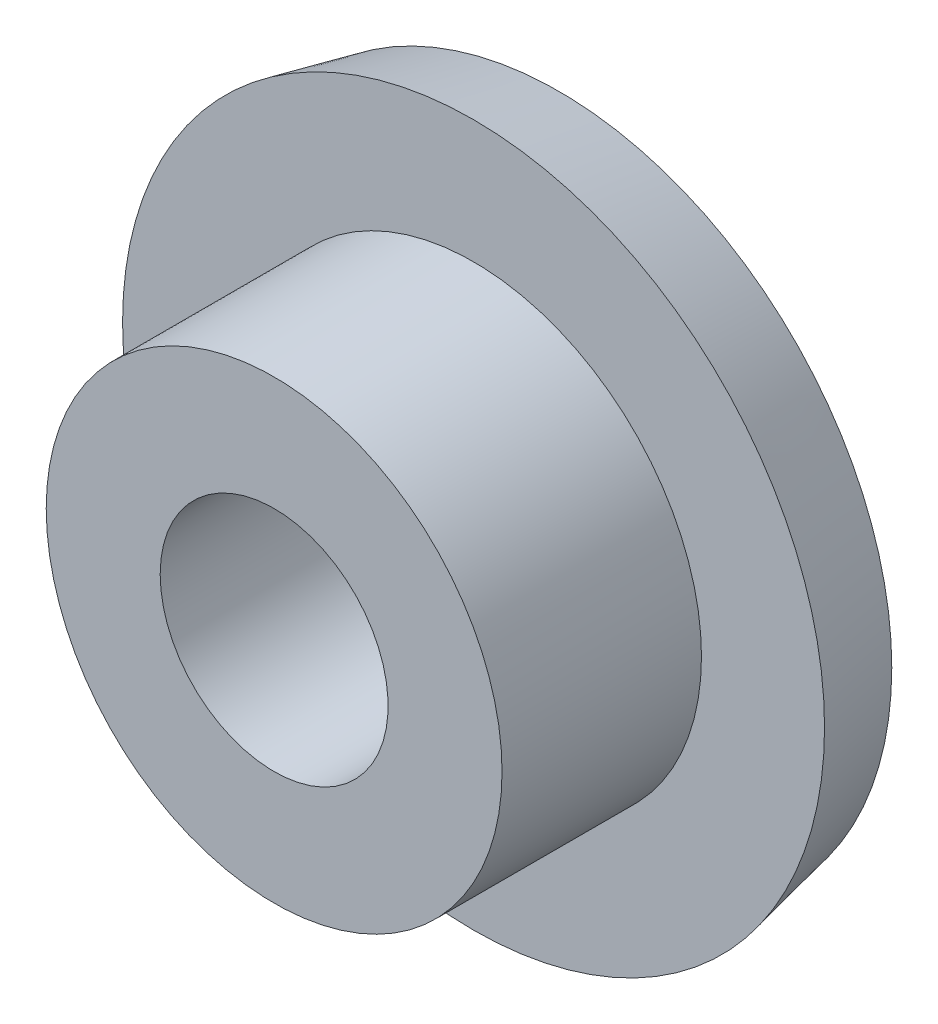
ISO-10303-21;
HEADER;
FILE_DESCRIPTION(('STEP AP214'),'2;1');
FILE_NAME('part.step','',(''),(''),'','','');
FILE_SCHEMA(('AUTOMOTIVE_DESIGN { 1 0 10303 214 1 1 1 1 }'));
ENDSEC;
DATA;
#1=APPLICATION_CONTEXT('core data for automotive mechanical design processes');
#2=APPLICATION_PROTOCOL_DEFINITION('international standard','automotive_design',2000,#1);
#3=PRODUCT_CONTEXT('',#1,'mechanical');
#4=PRODUCT('Part','Part','',(#3));
#5=PRODUCT_RELATED_PRODUCT_CATEGORY('part','',(#4));
#6=PRODUCT_DEFINITION_FORMATION('','',#4);
#7=PRODUCT_DEFINITION_CONTEXT('part definition',#1,'design');
#8=PRODUCT_DEFINITION('design','',#6,#7);
#9=PRODUCT_DEFINITION_SHAPE('','',#8);
#10=(LENGTH_UNIT() NAMED_UNIT(*) SI_UNIT(.MILLI.,.METRE.));
#11=(NAMED_UNIT(*) PLANE_ANGLE_UNIT() SI_UNIT($,.RADIAN.));
#12=(NAMED_UNIT(*) SI_UNIT($,.STERADIAN.) SOLID_ANGLE_UNIT());
#13=UNCERTAINTY_MEASURE_WITH_UNIT(LENGTH_MEASURE(1.E-05),#10,'distance_accuracy_value','');
#14=(GEOMETRIC_REPRESENTATION_CONTEXT(3) GLOBAL_UNCERTAINTY_ASSIGNED_CONTEXT((#13)) GLOBAL_UNIT_ASSIGNED_CONTEXT((#10,
#11,#12)) REPRESENTATION_CONTEXT('',''));
#15=CARTESIAN_POINT('',(0.,0.,0.));
#16=DIRECTION('',(0.,0.,1.));
#17=DIRECTION('',(1.,0.,0.));
#18=AXIS2_PLACEMENT_3D('',#15,#16,#17);
#19=CARTESIAN_POINT('',(0.,0.,11.1125));
#20=DIRECTION('',(0.,0.,-1.));
#21=DIRECTION('',(-1.,0.,0.));
#22=AXIS2_PLACEMENT_3D('',#19,#20,#21);
#23=CYLINDRICAL_SURFACE('',#22,12.7);
#24=CARTESIAN_POINT('',(0.,0.,0.));
#25=DIRECTION('',(0.,0.,-1.));
#26=DIRECTION('',(-1.,0.,0.));
#27=AXIS2_PLACEMENT_3D('',#24,#25,#26);
#28=CIRCLE('',#27,12.7);
#29=CARTESIAN_POINT('',(-12.7,0.,0.));
#30=VERTEX_POINT('',#29);
#31=EDGE_CURVE('E34',#30,#30,#28,.T.);
#32=ORIENTED_EDGE('',*,*,#31,.F.);
#33=EDGE_LOOP('',(#32));
#34=FACE_BOUND('',#33,.T.);
#35=CARTESIAN_POINT('',(0.,0.,11.1125));
#36=DIRECTION('',(0.,0.,-1.));
#37=DIRECTION('',(-1.,0.,0.));
#38=AXIS2_PLACEMENT_3D('',#35,#36,#37);
#39=CIRCLE('',#38,12.7);
#40=CARTESIAN_POINT('',(-12.7,0.,11.1125));
#41=VERTEX_POINT('',#40);
#42=EDGE_CURVE('E18',#41,#41,#39,.F.);
#43=ORIENTED_EDGE('',*,*,#42,.F.);
#44=EDGE_LOOP('',(#43));
#45=FACE_BOUND('',#44,.T.);
#46=ADVANCED_FACE('F15',(#34,#45),#23,.T.);
#47=CARTESIAN_POINT('',(0.,0.,11.1125));
#48=DIRECTION('',(0.,0.,1.));
#49=DIRECTION('',(1.,0.,0.));
#50=AXIS2_PLACEMENT_3D('',#47,#48,#49);
#51=PLANE('',#50);
#52=ORIENTED_EDGE('',*,*,#42,.T.);
#53=EDGE_LOOP('',(#52));
#54=FACE_BOUND('',#53,.T.);
#55=CARTESIAN_POINT('',(0.,0.,11.1125));
#56=DIRECTION('',(0.,0.,-1.));
#57=DIRECTION('',(-1.,0.,0.));
#58=AXIS2_PLACEMENT_3D('',#55,#56,#57);
#59=CIRCLE('',#58,6.35);
#60=CARTESIAN_POINT('',(-6.35,0.,11.1125));
#61=VERTEX_POINT('',#60);
#62=EDGE_CURVE('E32',#61,#61,#59,.T.);
#63=ORIENTED_EDGE('',*,*,#62,.T.);
#64=EDGE_LOOP('',(#63));
#65=FACE_BOUND('',#64,.T.);
#66=ADVANCED_FACE('F41',(#54,#65),#51,.T.);
#67=CARTESIAN_POINT('',(0.,0.,0.));
#68=DIRECTION('',(0.,0.,1.));
#69=DIRECTION('',(1.,0.,0.));
#70=AXIS2_PLACEMENT_3D('',#67,#68,#69);
#71=PLANE('',#70);
#72=ORIENTED_EDGE('',*,*,#31,.T.);
#73=EDGE_LOOP('',(#72));
#74=FACE_BOUND('',#73,.T.);
#75=CARTESIAN_POINT('',(0.,0.,0.));
#76=DIRECTION('',(0.,0.,1.));
#77=DIRECTION('',(1.,0.,0.));
#78=AXIS2_PLACEMENT_3D('',#75,#76,#77);
#79=CIRCLE('',#78,19.558);
#80=CARTESIAN_POINT('',(19.558,0.,0.));
#81=VERTEX_POINT('',#80);
#82=EDGE_CURVE('E27',#81,#81,#79,.F.);
#83=ORIENTED_EDGE('',*,*,#82,.F.);
#84=EDGE_LOOP('',(#83));
#85=FACE_BOUND('',#84,.T.);
#86=ADVANCED_FACE('F49',(#74,#85),#71,.T.);
#87=CARTESIAN_POINT('',(0.,0.,11.1125));
#88=DIRECTION('',(0.,0.,-1.));
#89=DIRECTION('',(-1.,0.,0.));
#90=AXIS2_PLACEMENT_3D('',#87,#88,#89);
#91=CYLINDRICAL_SURFACE('',#90,6.35);
#92=CARTESIAN_POINT('',(0.,0.,-4.7625));
#93=DIRECTION('',(0.,0.,-1.));
#94=DIRECTION('',(-1.,0.,0.));
#95=AXIS2_PLACEMENT_3D('',#92,#93,#94);
#96=CIRCLE('',#95,6.35);
#97=CARTESIAN_POINT('',(-6.35,0.,-4.7625));
#98=VERTEX_POINT('',#97);
#99=EDGE_CURVE('E22',#98,#98,#96,.F.);
#100=ORIENTED_EDGE('',*,*,#99,.F.);
#101=EDGE_LOOP('',(#100));
#102=FACE_BOUND('',#101,.T.);
#103=ORIENTED_EDGE('',*,*,#62,.F.);
#104=EDGE_LOOP('',(#103));
#105=FACE_BOUND('',#104,.T.);
#106=ADVANCED_FACE('F57',(#102,#105),#91,.F.);
#107=CARTESIAN_POINT('',(0.,0.,0.));
#108=DIRECTION('',(0.,0.,1.));
#109=DIRECTION('',(1.,0.,0.));
#110=AXIS2_PLACEMENT_3D('',#107,#108,#109);
#111=CONICAL_SURFACE('',#110,19.558,0.210182586662169);
#112=CARTESIAN_POINT('',(0.,0.,-4.7625));
#113=DIRECTION('',(0.,0.,1.));
#114=DIRECTION('',(1.,0.,0.));
#115=AXIS2_PLACEMENT_3D('',#112,#113,#114);
#116=CIRCLE('',#115,18.542);
#117=CARTESIAN_POINT('',(18.542,0.,-4.7625));
#118=VERTEX_POINT('',#117);
#119=EDGE_CURVE('E9',#118,#118,#116,.F.);
#120=ORIENTED_EDGE('',*,*,#119,.F.);
#121=EDGE_LOOP('',(#120));
#122=FACE_BOUND('',#121,.T.);
#123=ORIENTED_EDGE('',*,*,#82,.T.);
#124=EDGE_LOOP('',(#123));
#125=FACE_BOUND('',#124,.T.);
#126=ADVANCED_FACE('F52',(#122,#125),#111,.T.);
#127=CARTESIAN_POINT('',(18.542,0.,-4.7625));
#128=DIRECTION('',(0.,0.,-1.));
#129=DIRECTION('',(-1.,0.,0.));
#130=AXIS2_PLACEMENT_3D('',#127,#128,#129);
#131=PLANE('',#130);
#132=ORIENTED_EDGE('',*,*,#119,.T.);
#133=EDGE_LOOP('',(#132));
#134=FACE_BOUND('',#133,.T.);
#135=ORIENTED_EDGE('',*,*,#99,.T.);
#136=EDGE_LOOP('',(#135));
#137=FACE_BOUND('',#136,.T.);
#138=ADVANCED_FACE('F50',(#134,#137),#131,.T.);
#139=CLOSED_SHELL('',(#46,#66,#86,#106,#126,#138));
#140=MANIFOLD_SOLID_BREP('B1',#139);
#141=ADVANCED_BREP_SHAPE_REPRESENTATION('',(#18,#140),#14);
#142=SHAPE_DEFINITION_REPRESENTATION(#9,#141);
ENDSEC;
END-ISO-10303-21;
